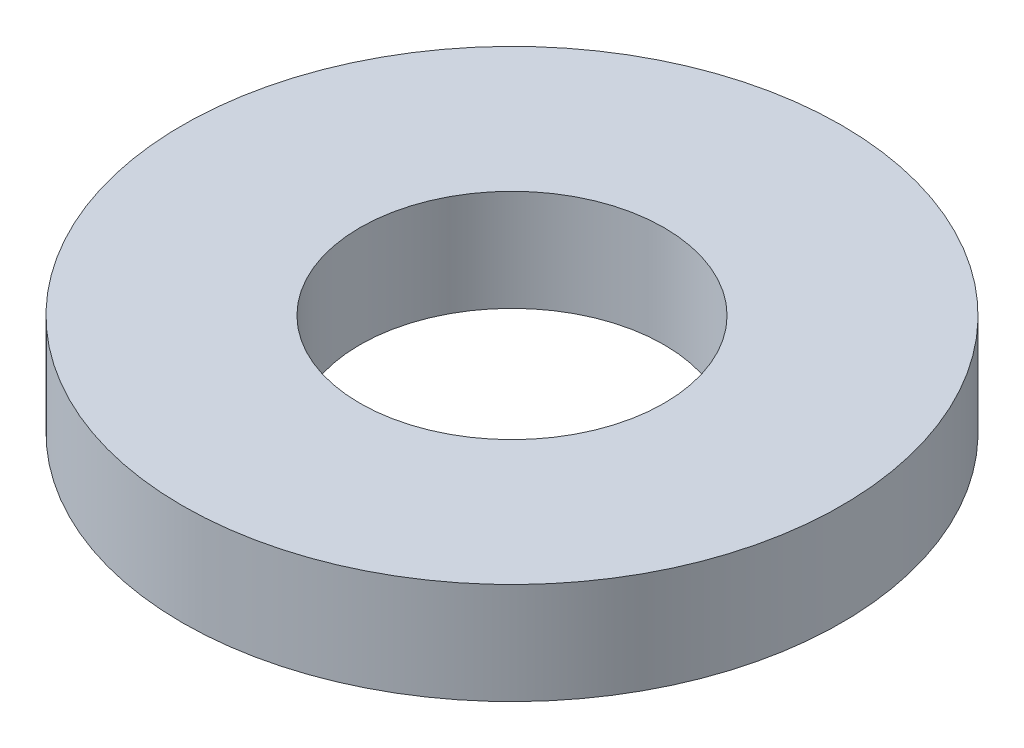
ISO-10303-21;
HEADER;
FILE_DESCRIPTION(('STEP AP214'),'2;1');
FILE_NAME('part.step','',(''),(''),'','','');
FILE_SCHEMA(('AUTOMOTIVE_DESIGN { 1 0 10303 214 1 1 1 1 }'));
ENDSEC;
DATA;
#1=APPLICATION_CONTEXT('core data for automotive mechanical design processes');
#2=APPLICATION_PROTOCOL_DEFINITION('international standard','automotive_design',2000,#1);
#3=PRODUCT_CONTEXT('',#1,'mechanical');
#4=PRODUCT('Part','Part','',(#3));
#5=PRODUCT_RELATED_PRODUCT_CATEGORY('part','',(#4));
#6=PRODUCT_DEFINITION_FORMATION('','',#4);
#7=PRODUCT_DEFINITION_CONTEXT('part definition',#1,'design');
#8=PRODUCT_DEFINITION('design','',#6,#7);
#9=PRODUCT_DEFINITION_SHAPE('','',#8);
#10=(LENGTH_UNIT() NAMED_UNIT(*) SI_UNIT(.MILLI.,.METRE.));
#11=(NAMED_UNIT(*) PLANE_ANGLE_UNIT() SI_UNIT($,.RADIAN.));
#12=(NAMED_UNIT(*) SI_UNIT($,.STERADIAN.) SOLID_ANGLE_UNIT());
#13=UNCERTAINTY_MEASURE_WITH_UNIT(LENGTH_MEASURE(1.E-05),#10,'distance_accuracy_value','');
#14=(GEOMETRIC_REPRESENTATION_CONTEXT(3) GLOBAL_UNCERTAINTY_ASSIGNED_CONTEXT((#13)) GLOBAL_UNIT_ASSIGNED_CONTEXT((#10,
#11,#12)) REPRESENTATION_CONTEXT('',''));
#15=CARTESIAN_POINT('',(0.,0.,0.));
#16=DIRECTION('',(0.,0.,1.));
#17=DIRECTION('',(1.,0.,0.));
#18=AXIS2_PLACEMENT_3D('',#15,#16,#17);
#19=CARTESIAN_POINT('',(0.,2.,0.));
#20=DIRECTION('',(0.,1.,0.));
#21=DIRECTION('',(0.,0.,1.));
#22=AXIS2_PLACEMENT_3D('',#19,#20,#21);
#23=PLANE('',#22);
#24=CARTESIAN_POINT('',(0.,2.,0.));
#25=DIRECTION('',(0.,1.,0.));
#26=DIRECTION('',(0.,0.,1.));
#27=AXIS2_PLACEMENT_3D('',#24,#25,#26);
#28=CIRCLE('',#27,6.5);
#29=CARTESIAN_POINT('',(0.,2.,6.5));
#30=VERTEX_POINT('',#29);
#31=EDGE_CURVE('E10',#30,#30,#28,.T.);
#32=ORIENTED_EDGE('',*,*,#31,.T.);
#33=EDGE_LOOP('',(#32));
#34=FACE_BOUND('',#33,.T.);
#35=CARTESIAN_POINT('',(0.,2.,0.));
#36=DIRECTION('',(0.,1.,0.));
#37=DIRECTION('',(0.,0.,1.));
#38=AXIS2_PLACEMENT_3D('',#35,#36,#37);
#39=CIRCLE('',#38,3.);
#40=CARTESIAN_POINT('',(0.,2.,3.));
#41=VERTEX_POINT('',#40);
#42=EDGE_CURVE('E42',#41,#41,#39,.T.);
#43=ORIENTED_EDGE('',*,*,#42,.F.);
#44=EDGE_LOOP('',(#43));
#45=FACE_BOUND('',#44,.T.);
#46=ADVANCED_FACE('F31',(#34,#45),#23,.T.);
#47=CARTESIAN_POINT('',(0.,0.,0.));
#48=DIRECTION('',(0.,1.,0.));
#49=DIRECTION('',(0.,0.,1.));
#50=AXIS2_PLACEMENT_3D('',#47,#48,#49);
#51=PLANE('',#50);
#52=CARTESIAN_POINT('',(0.,0.,0.));
#53=DIRECTION('',(0.,1.,0.));
#54=DIRECTION('',(0.,0.,1.));
#55=AXIS2_PLACEMENT_3D('',#52,#53,#54);
#56=CIRCLE('',#55,6.5);
#57=CARTESIAN_POINT('',(0.,0.,6.5));
#58=VERTEX_POINT('',#57);
#59=EDGE_CURVE('E35',#58,#58,#56,.T.);
#60=ORIENTED_EDGE('',*,*,#59,.F.);
#61=EDGE_LOOP('',(#60));
#62=FACE_BOUND('',#61,.T.);
#63=CARTESIAN_POINT('',(0.,0.,0.));
#64=DIRECTION('',(0.,1.,0.));
#65=DIRECTION('',(0.,0.,1.));
#66=AXIS2_PLACEMENT_3D('',#63,#64,#65);
#67=CIRCLE('',#66,3.);
#68=CARTESIAN_POINT('',(0.,0.,3.));
#69=VERTEX_POINT('',#68);
#70=EDGE_CURVE('E44',#69,#69,#67,.T.);
#71=ORIENTED_EDGE('',*,*,#70,.T.);
#72=EDGE_LOOP('',(#71));
#73=FACE_BOUND('',#72,.T.);
#74=ADVANCED_FACE('F54',(#62,#73),#51,.F.);
#75=CARTESIAN_POINT('',(0.,2.,0.));
#76=DIRECTION('',(0.,-1.,0.));
#77=DIRECTION('',(0.,0.,-1.));
#78=AXIS2_PLACEMENT_3D('',#75,#76,#77);
#79=CYLINDRICAL_SURFACE('',#78,6.5);
#80=ORIENTED_EDGE('',*,*,#31,.F.);
#81=EDGE_LOOP('',(#80));
#82=FACE_BOUND('',#81,.T.);
#83=ORIENTED_EDGE('',*,*,#59,.T.);
#84=EDGE_LOOP('',(#83));
#85=FACE_BOUND('',#84,.T.);
#86=ADVANCED_FACE('F33',(#82,#85),#79,.T.);
#87=CARTESIAN_POINT('',(0.,2.,0.));
#88=DIRECTION('',(0.,-1.,0.));
#89=DIRECTION('',(0.,0.,-1.));
#90=AXIS2_PLACEMENT_3D('',#87,#88,#89);
#91=CYLINDRICAL_SURFACE('',#90,3.);
#92=ORIENTED_EDGE('',*,*,#42,.T.);
#93=EDGE_LOOP('',(#92));
#94=FACE_BOUND('',#93,.T.);
#95=ORIENTED_EDGE('',*,*,#70,.F.);
#96=EDGE_LOOP('',(#95));
#97=FACE_BOUND('',#96,.T.);
#98=ADVANCED_FACE('F50',(#94,#97),#91,.F.);
#99=CLOSED_SHELL('',(#46,#74,#86,#98));
#100=MANIFOLD_SOLID_BREP('B2',#99);
#101=ADVANCED_BREP_SHAPE_REPRESENTATION('',(#18,#100),#14);
#102=SHAPE_DEFINITION_REPRESENTATION(#9,#101);
ENDSEC;
END-ISO-10303-21;
